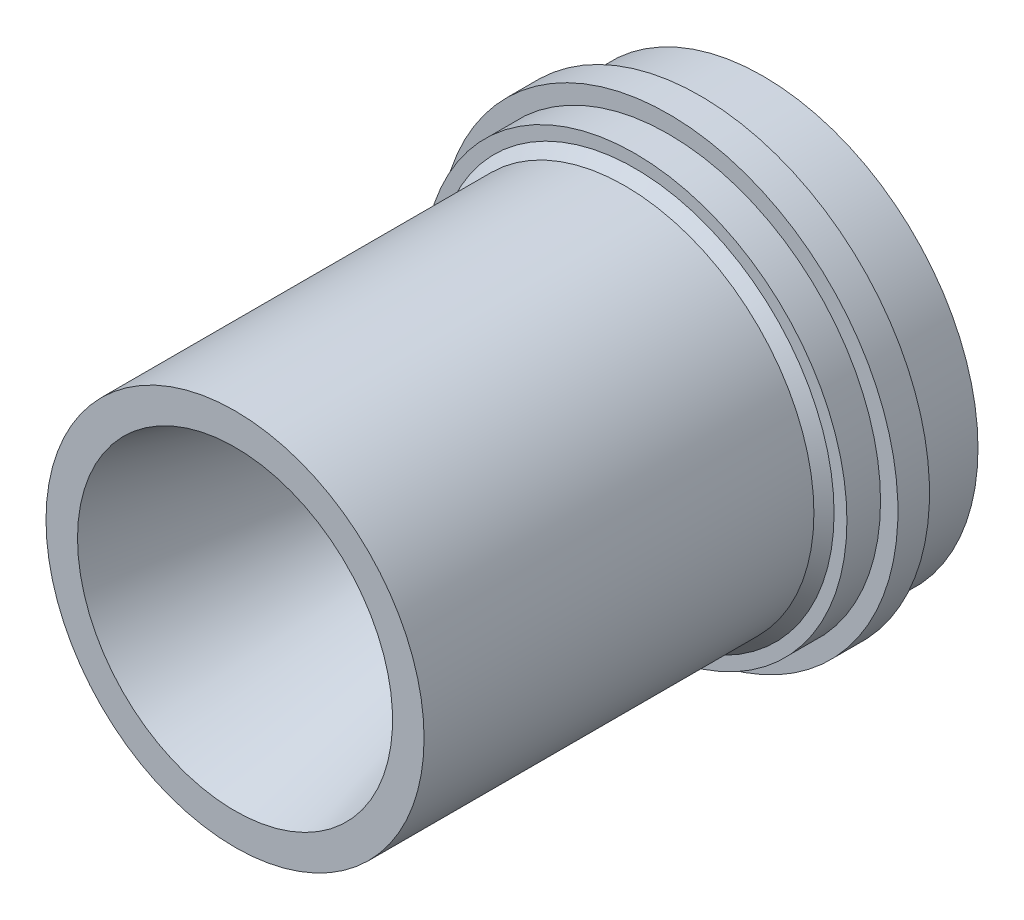
ISO-10303-21;
HEADER;
FILE_DESCRIPTION(('STEP AP214'),'2;1');
FILE_NAME('part.step','',(''),(''),'','','');
FILE_SCHEMA(('AUTOMOTIVE_DESIGN { 1 0 10303 214 1 1 1 1 }'));
ENDSEC;
DATA;
#1=APPLICATION_CONTEXT('core data for automotive mechanical design processes');
#2=APPLICATION_PROTOCOL_DEFINITION('international standard','automotive_design',2000,#1);
#3=PRODUCT_CONTEXT('',#1,'mechanical');
#4=PRODUCT('Part','Part','',(#3));
#5=PRODUCT_RELATED_PRODUCT_CATEGORY('part','',(#4));
#6=PRODUCT_DEFINITION_FORMATION('','',#4);
#7=PRODUCT_DEFINITION_CONTEXT('part definition',#1,'design');
#8=PRODUCT_DEFINITION('design','',#6,#7);
#9=PRODUCT_DEFINITION_SHAPE('','',#8);
#10=(LENGTH_UNIT() NAMED_UNIT(*) SI_UNIT(.MILLI.,.METRE.));
#11=(NAMED_UNIT(*) PLANE_ANGLE_UNIT() SI_UNIT($,.RADIAN.));
#12=(NAMED_UNIT(*) SI_UNIT($,.STERADIAN.) SOLID_ANGLE_UNIT());
#13=UNCERTAINTY_MEASURE_WITH_UNIT(LENGTH_MEASURE(1.E-05),#10,'distance_accuracy_value','');
#14=(GEOMETRIC_REPRESENTATION_CONTEXT(3) GLOBAL_UNCERTAINTY_ASSIGNED_CONTEXT((#13)) GLOBAL_UNIT_ASSIGNED_CONTEXT((#10,
#11,#12)) REPRESENTATION_CONTEXT('',''));
#15=CARTESIAN_POINT('',(0.,0.,0.));
#16=DIRECTION('',(0.,0.,1.));
#17=DIRECTION('',(1.,0.,0.));
#18=AXIS2_PLACEMENT_3D('',#15,#16,#17);
#19=CARTESIAN_POINT('',(0.,23.8125,79.8322));
#20=DIRECTION('',(0.,0.,1.));
#21=DIRECTION('',(1.,0.,0.));
#22=AXIS2_PLACEMENT_3D('',#19,#20,#21);
#23=PLANE('',#22);
#24=CARTESIAN_POINT('',(0.,0.,79.8322));
#25=DIRECTION('',(0.,0.,-1.));
#26=DIRECTION('',(-1.,0.,0.));
#27=AXIS2_PLACEMENT_3D('',#24,#25,#26);
#28=CIRCLE('',#27,23.8125);
#29=CARTESIAN_POINT('',(-23.8125,0.,79.8322));
#30=VERTEX_POINT('',#29);
#31=EDGE_CURVE('E102',#30,#30,#28,.T.);
#32=ORIENTED_EDGE('',*,*,#31,.T.);
#33=EDGE_LOOP('',(#32));
#34=FACE_BOUND('',#33,.T.);
#35=CARTESIAN_POINT('',(0.,0.,79.8322));
#36=DIRECTION('',(0.,0.,-1.));
#37=DIRECTION('',(-1.,0.,0.));
#38=AXIS2_PLACEMENT_3D('',#35,#36,#37);
#39=CIRCLE('',#38,28.575);
#40=CARTESIAN_POINT('',(-28.575,0.,79.8322));
#41=VERTEX_POINT('',#40);
#42=EDGE_CURVE('E10',#41,#41,#39,.T.);
#43=ORIENTED_EDGE('',*,*,#42,.F.);
#44=EDGE_LOOP('',(#43));
#45=FACE_BOUND('',#44,.T.);
#46=ADVANCED_FACE('F43',(#34,#45),#23,.T.);
#47=CARTESIAN_POINT('',(0.,0.,0.));
#48=DIRECTION('',(0.,0.,-1.));
#49=DIRECTION('',(-1.,0.,0.));
#50=AXIS2_PLACEMENT_3D('',#47,#48,#49);
#51=CYLINDRICAL_SURFACE('',#50,28.575);
#52=ORIENTED_EDGE('',*,*,#42,.T.);
#53=EDGE_LOOP('',(#52));
#54=FACE_BOUND('',#53,.T.);
#55=CARTESIAN_POINT('',(0.,0.,20.9042));
#56=DIRECTION('',(0.,0.,-1.));
#57=DIRECTION('',(-1.,0.,0.));
#58=AXIS2_PLACEMENT_3D('',#55,#56,#57);
#59=CIRCLE('',#58,28.575);
#60=CARTESIAN_POINT('',(-28.575,0.,20.9042));
#61=VERTEX_POINT('',#60);
#62=EDGE_CURVE('E50',#61,#61,#59,.T.);
#63=ORIENTED_EDGE('',*,*,#62,.F.);
#64=EDGE_LOOP('',(#63));
#65=FACE_BOUND('',#64,.T.);
#66=ADVANCED_FACE('F121',(#54,#65),#51,.T.);
#67=CARTESIAN_POINT('',(0.,0.,19.3802));
#68=DIRECTION('',(0.,0.,-1.));
#69=DIRECTION('',(-1.,0.,0.));
#70=AXIS2_PLACEMENT_3D('',#67,#68,#69);
#71=CONICAL_SURFACE('',#70,30.099,0.785398163397446);
#72=ORIENTED_EDGE('',*,*,#62,.T.);
#73=EDGE_LOOP('',(#72));
#74=FACE_BOUND('',#73,.T.);
#75=CARTESIAN_POINT('',(0.,0.,19.3802));
#76=DIRECTION('',(0.,0.,-1.));
#77=DIRECTION('',(-1.,0.,0.));
#78=AXIS2_PLACEMENT_3D('',#75,#76,#77);
#79=CIRCLE('',#78,30.099);
#80=CARTESIAN_POINT('',(-30.099,0.,19.3802));
#81=VERTEX_POINT('',#80);
#82=EDGE_CURVE('E55',#81,#81,#79,.T.);
#83=ORIENTED_EDGE('',*,*,#82,.F.);
#84=EDGE_LOOP('',(#83));
#85=FACE_BOUND('',#84,.T.);
#86=ADVANCED_FACE('F125',(#74,#85),#71,.T.);
#87=CARTESIAN_POINT('',(0.,30.099,19.3802));
#88=DIRECTION('',(0.,0.,1.));
#89=DIRECTION('',(1.,0.,0.));
#90=AXIS2_PLACEMENT_3D('',#87,#88,#89);
#91=PLANE('',#90);
#92=ORIENTED_EDGE('',*,*,#82,.T.);
#93=EDGE_LOOP('',(#92));
#94=FACE_BOUND('',#93,.T.);
#95=CARTESIAN_POINT('',(0.,0.,19.3802));
#96=DIRECTION('',(0.,0.,-1.));
#97=DIRECTION('',(-1.,0.,0.));
#98=AXIS2_PLACEMENT_3D('',#95,#96,#97);
#99=CIRCLE('',#98,32.0421);
#100=CARTESIAN_POINT('',(-32.0421,0.,19.3802));
#101=VERTEX_POINT('',#100);
#102=EDGE_CURVE('E60',#101,#101,#99,.T.);
#103=ORIENTED_EDGE('',*,*,#102,.F.);
#104=EDGE_LOOP('',(#103));
#105=FACE_BOUND('',#104,.T.);
#106=ADVANCED_FACE('F129',(#94,#105),#91,.T.);
#107=CARTESIAN_POINT('',(0.,0.,0.));
#108=DIRECTION('',(0.,0.,-1.));
#109=DIRECTION('',(-1.,0.,0.));
#110=AXIS2_PLACEMENT_3D('',#107,#108,#109);
#111=CYLINDRICAL_SURFACE('',#110,32.0421);
#112=ORIENTED_EDGE('',*,*,#102,.T.);
#113=EDGE_LOOP('',(#112));
#114=FACE_BOUND('',#113,.T.);
#115=CARTESIAN_POINT('',(0.,0.,14.3002));
#116=DIRECTION('',(0.,0.,-1.));
#117=DIRECTION('',(-1.,0.,0.));
#118=AXIS2_PLACEMENT_3D('',#115,#116,#117);
#119=CIRCLE('',#118,32.0421);
#120=CARTESIAN_POINT('',(-32.0421,0.,14.3002));
#121=VERTEX_POINT('',#120);
#122=EDGE_CURVE('E66',#121,#121,#119,.T.);
#123=ORIENTED_EDGE('',*,*,#122,.F.);
#124=EDGE_LOOP('',(#123));
#125=FACE_BOUND('',#124,.T.);
#126=ADVANCED_FACE('F135',(#114,#125),#111,.T.);
#127=CARTESIAN_POINT('',(0.,32.0421,14.3002));
#128=DIRECTION('',(0.,0.,1.));
#129=DIRECTION('',(1.,0.,0.));
#130=AXIS2_PLACEMENT_3D('',#127,#128,#129);
#131=PLANE('',#130);
#132=ORIENTED_EDGE('',*,*,#122,.T.);
#133=EDGE_LOOP('',(#132));
#134=FACE_BOUND('',#133,.T.);
#135=CARTESIAN_POINT('',(0.,0.,14.3002));
#136=DIRECTION('',(0.,0.,-1.));
#137=DIRECTION('',(-1.,0.,0.));
#138=AXIS2_PLACEMENT_3D('',#135,#136,#137);
#139=CIRCLE('',#138,34.671);
#140=CARTESIAN_POINT('',(-34.671,0.,14.3002));
#141=VERTEX_POINT('',#140);
#142=EDGE_CURVE('E70',#141,#141,#139,.T.);
#143=ORIENTED_EDGE('',*,*,#142,.F.);
#144=EDGE_LOOP('',(#143));
#145=FACE_BOUND('',#144,.T.);
#146=ADVANCED_FACE('F139',(#134,#145),#131,.T.);
#147=CARTESIAN_POINT('',(0.,0.,0.));
#148=DIRECTION('',(0.,0.,-1.));
#149=DIRECTION('',(-1.,0.,0.));
#150=AXIS2_PLACEMENT_3D('',#147,#148,#149);
#151=CYLINDRICAL_SURFACE('',#150,34.671);
#152=ORIENTED_EDGE('',*,*,#142,.T.);
#153=EDGE_LOOP('',(#152));
#154=FACE_BOUND('',#153,.T.);
#155=CARTESIAN_POINT('',(0.,0.,9.525));
#156=DIRECTION('',(0.,0.,-1.));
#157=DIRECTION('',(-1.,0.,0.));
#158=AXIS2_PLACEMENT_3D('',#155,#156,#157);
#159=CIRCLE('',#158,34.671);
#160=CARTESIAN_POINT('',(-34.671,0.,9.525));
#161=VERTEX_POINT('',#160);
#162=EDGE_CURVE('E74',#161,#161,#159,.T.);
#163=ORIENTED_EDGE('',*,*,#162,.F.);
#164=EDGE_LOOP('',(#163));
#165=FACE_BOUND('',#164,.T.);
#166=ADVANCED_FACE('F143',(#154,#165),#151,.T.);
#167=CARTESIAN_POINT('',(0.,34.671,9.525));
#168=DIRECTION('',(0.,0.,-1.));
#169=DIRECTION('',(-1.,0.,0.));
#170=AXIS2_PLACEMENT_3D('',#167,#168,#169);
#171=PLANE('',#170);
#172=ORIENTED_EDGE('',*,*,#162,.T.);
#173=EDGE_LOOP('',(#172));
#174=FACE_BOUND('',#173,.T.);
#175=CARTESIAN_POINT('',(0.,0.,9.525));
#176=DIRECTION('',(0.,0.,-1.));
#177=DIRECTION('',(-1.,0.,0.));
#178=AXIS2_PLACEMENT_3D('',#175,#176,#177);
#179=CIRCLE('',#178,32.4739);
#180=CARTESIAN_POINT('',(-32.4739,0.,9.525));
#181=VERTEX_POINT('',#180);
#182=EDGE_CURVE('E78',#181,#181,#179,.T.);
#183=ORIENTED_EDGE('',*,*,#182,.F.);
#184=EDGE_LOOP('',(#183));
#185=FACE_BOUND('',#184,.T.);
#186=ADVANCED_FACE('F147',(#174,#185),#171,.T.);
#187=CARTESIAN_POINT('',(0.,0.,0.));
#188=DIRECTION('',(0.,0.,-1.));
#189=DIRECTION('',(-1.,0.,0.));
#190=AXIS2_PLACEMENT_3D('',#187,#188,#189);
#191=CYLINDRICAL_SURFACE('',#190,32.4739);
#192=ORIENTED_EDGE('',*,*,#182,.T.);
#193=EDGE_LOOP('',(#192));
#194=FACE_BOUND('',#193,.T.);
#195=CARTESIAN_POINT('',(0.,0.,0.));
#196=DIRECTION('',(0.,0.,-1.));
#197=DIRECTION('',(-1.,0.,0.));
#198=AXIS2_PLACEMENT_3D('',#195,#196,#197);
#199=CIRCLE('',#198,32.4739);
#200=CARTESIAN_POINT('',(-32.4739,0.,0.));
#201=VERTEX_POINT('',#200);
#202=EDGE_CURVE('E82',#201,#201,#199,.T.);
#203=ORIENTED_EDGE('',*,*,#202,.F.);
#204=EDGE_LOOP('',(#203));
#205=FACE_BOUND('',#204,.T.);
#206=ADVANCED_FACE('F151',(#194,#205),#191,.T.);
#207=CARTESIAN_POINT('',(0.,32.4739,0.));
#208=DIRECTION('',(0.,0.,-1.));
#209=DIRECTION('',(-1.,0.,0.));
#210=AXIS2_PLACEMENT_3D('',#207,#208,#209);
#211=PLANE('',#210);
#212=ORIENTED_EDGE('',*,*,#202,.T.);
#213=EDGE_LOOP('',(#212));
#214=FACE_BOUND('',#213,.T.);
#215=CARTESIAN_POINT('',(0.,0.,0.));
#216=DIRECTION('',(0.,0.,-1.));
#217=DIRECTION('',(-1.,0.,0.));
#218=AXIS2_PLACEMENT_3D('',#215,#216,#217);
#219=CIRCLE('',#218,26.5811);
#220=CARTESIAN_POINT('',(-26.5811,0.,0.));
#221=VERTEX_POINT('',#220);
#222=EDGE_CURVE('E86',#221,#221,#219,.T.);
#223=ORIENTED_EDGE('',*,*,#222,.F.);
#224=EDGE_LOOP('',(#223));
#225=FACE_BOUND('',#224,.T.);
#226=ADVANCED_FACE('F155',(#214,#225),#211,.T.);
#227=CARTESIAN_POINT('',(0.,0.,6.19594565765928));
#228=DIRECTION('',(0.,0.,-1.));
#229=DIRECTION('',(-1.,0.,0.));
#230=AXIS2_PLACEMENT_3D('',#227,#228,#229);
#231=CONICAL_SURFACE('',#230,15.8494073199983,1.0471975511966);
#232=ORIENTED_EDGE('',*,*,#222,.T.);
#233=EDGE_LOOP('',(#232));
#234=FACE_BOUND('',#233,.T.);
#235=CARTESIAN_POINT('',(0.,0.,6.19594565765928));
#236=DIRECTION('',(0.,0.,-1.));
#237=DIRECTION('',(-1.,0.,0.));
#238=AXIS2_PLACEMENT_3D('',#235,#236,#237);
#239=CIRCLE('',#238,15.8494073199983);
#240=CARTESIAN_POINT('',(-15.8494073199983,0.,6.19594565765928));
#241=VERTEX_POINT('',#240);
#242=EDGE_CURVE('E90',#241,#241,#239,.T.);
#243=ORIENTED_EDGE('',*,*,#242,.F.);
#244=EDGE_LOOP('',(#243));
#245=FACE_BOUND('',#244,.T.);
#246=ADVANCED_FACE('F159',(#234,#245),#231,.F.);
#247=CARTESIAN_POINT('',(0.,0.,18.5802821368575));
#248=DIRECTION('',(0.,0.,-1.));
#249=DIRECTION('',(-1.,0.,0.));
#250=AXIS2_PLACEMENT_3D('',#247,#248,#249);
#251=TOROIDAL_SURFACE('',#250,22.9995073199983,14.3002);
#252=ORIENTED_EDGE('',*,*,#242,.T.);
#253=EDGE_LOOP('',(#252));
#254=FACE_BOUND('',#253,.T.);
#255=CARTESIAN_POINT('',(0.,0.,18.6545161452117));
#256=DIRECTION('',(0.,0.,-1.));
#257=DIRECTION('',(-1.,0.,0.));
#258=AXIS2_PLACEMENT_3D('',#255,#256,#257);
#259=CIRCLE('',#258,8.6995);
#260=CARTESIAN_POINT('',(-8.6995,0.,18.6545161452117));
#261=VERTEX_POINT('',#260);
#262=EDGE_CURVE('E94',#261,#261,#259,.T.);
#263=ORIENTED_EDGE('',*,*,#262,.F.);
#264=EDGE_LOOP('',(#263));
#265=FACE_BOUND('',#264,.T.);
#266=ADVANCED_FACE('F117',(#254,#265),#251,.T.);
#267=CARTESIAN_POINT('',(0.,0.,0.));
#268=DIRECTION('',(0.,0.,-1.));
#269=DIRECTION('',(-1.,0.,0.));
#270=AXIS2_PLACEMENT_3D('',#267,#268,#269);
#271=CYLINDRICAL_SURFACE('',#270,8.6995);
#272=ORIENTED_EDGE('',*,*,#262,.T.);
#273=EDGE_LOOP('',(#272));
#274=FACE_BOUND('',#273,.T.);
#275=CARTESIAN_POINT('',(0.,0.,23.4297161452117));
#276=DIRECTION('',(0.,0.,-1.));
#277=DIRECTION('',(-1.,0.,0.));
#278=AXIS2_PLACEMENT_3D('',#275,#276,#277);
#279=CIRCLE('',#278,8.6995);
#280=CARTESIAN_POINT('',(-8.6995,0.,23.4297161452117));
#281=VERTEX_POINT('',#280);
#282=EDGE_CURVE('E98',#281,#281,#279,.T.);
#283=ORIENTED_EDGE('',*,*,#282,.F.);
#284=EDGE_LOOP('',(#283));
#285=FACE_BOUND('',#284,.T.);
#286=ADVANCED_FACE('F111',(#274,#285),#271,.F.);
#287=CARTESIAN_POINT('',(0.,0.,79.8322));
#288=DIRECTION('',(0.,0.,1.));
#289=DIRECTION('',(1.,0.,0.));
#290=AXIS2_PLACEMENT_3D('',#287,#288,#289);
#291=CONICAL_SURFACE('',#290,23.8125,0.26179938779915);
#292=ORIENTED_EDGE('',*,*,#282,.T.);
#293=EDGE_LOOP('',(#292));
#294=FACE_BOUND('',#293,.T.);
#295=ORIENTED_EDGE('',*,*,#31,.F.);
#296=EDGE_LOOP('',(#295));
#297=FACE_BOUND('',#296,.T.);
#298=ADVANCED_FACE('F109',(#294,#297),#291,.F.);
#299=CLOSED_SHELL('',(#46,#66,#86,#106,#126,#146,#166,#186,#206,#226,#246,#266,#286,#298));
#300=MANIFOLD_SOLID_BREP('B2',#299);
#301=ADVANCED_BREP_SHAPE_REPRESENTATION('',(#18,#300),#14);
#302=SHAPE_DEFINITION_REPRESENTATION(#9,#301);
ENDSEC;
END-ISO-10303-21;
